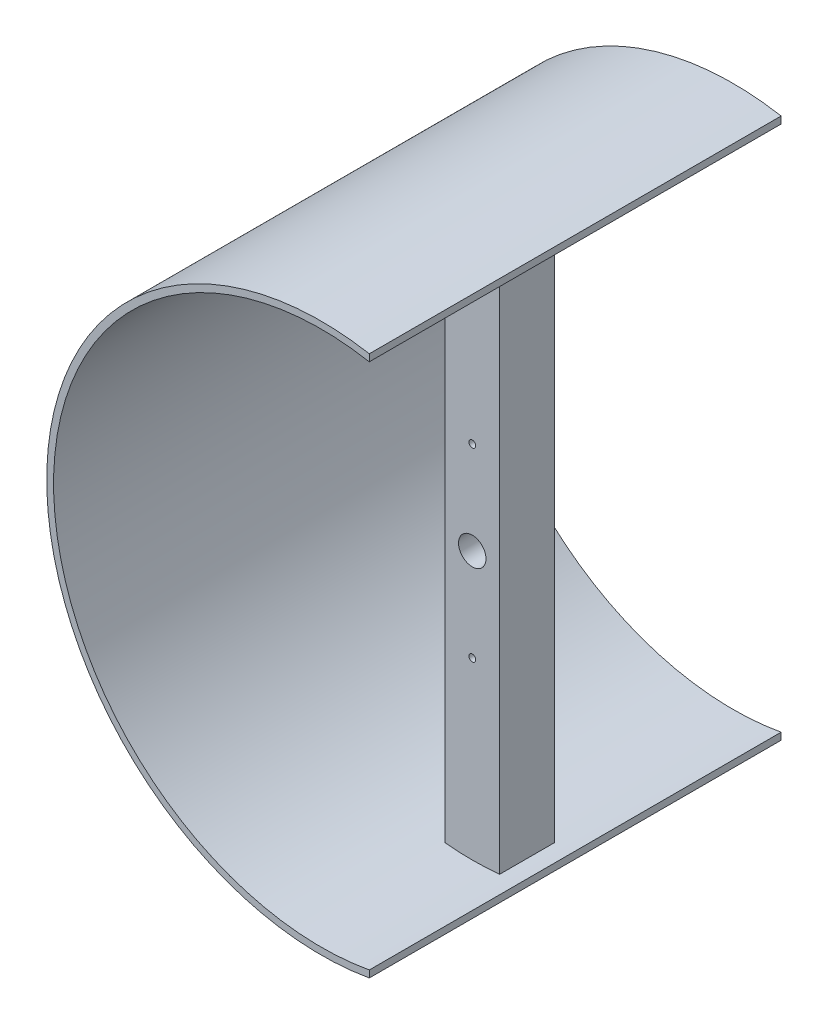
ISO-10303-21;
HEADER;
FILE_DESCRIPTION(('STEP AP214'),'2;1');
FILE_NAME('part.step','',(''),(''),'','','');
FILE_SCHEMA(('AUTOMOTIVE_DESIGN { 1 0 10303 214 1 1 1 1 }'));
ENDSEC;
DATA;
#1=APPLICATION_CONTEXT('core data for automotive mechanical design processes');
#2=APPLICATION_PROTOCOL_DEFINITION('international standard','automotive_design',2000,#1);
#3=PRODUCT_CONTEXT('',#1,'mechanical');
#4=PRODUCT('Part','Part','',(#3));
#5=PRODUCT_RELATED_PRODUCT_CATEGORY('part','',(#4));
#6=PRODUCT_DEFINITION_FORMATION('','',#4);
#7=PRODUCT_DEFINITION_CONTEXT('part definition',#1,'design');
#8=PRODUCT_DEFINITION('design','',#6,#7);
#9=PRODUCT_DEFINITION_SHAPE('','',#8);
#10=(LENGTH_UNIT() NAMED_UNIT(*) SI_UNIT(.MILLI.,.METRE.));
#11=(NAMED_UNIT(*) PLANE_ANGLE_UNIT() SI_UNIT($,.RADIAN.));
#12=(NAMED_UNIT(*) SI_UNIT($,.STERADIAN.) SOLID_ANGLE_UNIT());
#13=UNCERTAINTY_MEASURE_WITH_UNIT(LENGTH_MEASURE(1.E-05),#10,'distance_accuracy_value','');
#14=(GEOMETRIC_REPRESENTATION_CONTEXT(3) GLOBAL_UNCERTAINTY_ASSIGNED_CONTEXT((#13)) GLOBAL_UNIT_ASSIGNED_CONTEXT((#10,
#11,#12)) REPRESENTATION_CONTEXT('',''));
#15=CARTESIAN_POINT('',(0.,0.,0.));
#16=DIRECTION('',(0.,0.,1.));
#17=DIRECTION('',(1.,0.,0.));
#18=AXIS2_PLACEMENT_3D('',#15,#16,#17);
#19=CARTESIAN_POINT('',(0.,0.,60.));
#20=DIRECTION('',(0.,0.,-1.));
#21=DIRECTION('',(-1.,0.,0.));
#22=AXIS2_PLACEMENT_3D('',#19,#20,#21);
#23=PLANE('',#22);
#24=DIRECTION('',(0.,1.,0.));
#25=VECTOR('',#24,1.);
#26=CARTESIAN_POINT('',(11.,80.5,60.));
#27=LINE('',#26,#25);
#28=CARTESIAN_POINT('',(11.,0.117262664969565,60.));
#29=VERTEX_POINT('',#28);
#30=CARTESIAN_POINT('',(11.,1.13334781349824,60.));
#31=VERTEX_POINT('',#30);
#32=EDGE_CURVE('E65',#29,#31,#27,.T.);
#33=ORIENTED_EDGE('',*,*,#32,.T.);
#34=CARTESIAN_POINT('',(4.,39.5,60.));
#35=DIRECTION('',(0.,0.,-1.));
#36=DIRECTION('',(-1.,0.,0.));
#37=AXIS2_PLACEMENT_3D('',#34,#35,#36);
#38=CIRCLE('',#37,39.);
#39=CARTESIAN_POINT('',(11.,77.8666521865018,60.));
#40=VERTEX_POINT('',#39);
#41=EDGE_CURVE('E168',#31,#40,#38,.T.);
#42=ORIENTED_EDGE('',*,*,#41,.T.);
#43=CARTESIAN_POINT('',(11.,78.8827373350304,60.));
#44=VERTEX_POINT('',#43);
#45=EDGE_CURVE('E154',#40,#44,#27,.T.);
#46=ORIENTED_EDGE('',*,*,#45,.T.);
#47=CARTESIAN_POINT('',(4.,39.5,60.));
#48=DIRECTION('',(0.,0.,-1.));
#49=DIRECTION('',(-1.,0.,0.));
#50=AXIS2_PLACEMENT_3D('',#47,#48,#49);
#51=CIRCLE('',#50,40.);
#52=EDGE_CURVE('E166',#29,#44,#51,.T.);
#53=ORIENTED_EDGE('',*,*,#52,.F.);
#54=EDGE_LOOP('',(#33,#42,#46,#53));
#55=FACE_BOUND('',#54,.T.);
#56=ADVANCED_FACE('F39',(#55),#23,.F.);
#57=CARTESIAN_POINT('',(0.,0.,0.));
#58=DIRECTION('',(0.,0.,-1.));
#59=DIRECTION('',(-1.,0.,0.));
#60=AXIS2_PLACEMENT_3D('',#57,#58,#59);
#61=PLANE('',#60);
#62=CARTESIAN_POINT('',(4.,39.5,0.));
#63=DIRECTION('',(0.,0.,-1.));
#64=DIRECTION('',(-1.,0.,0.));
#65=AXIS2_PLACEMENT_3D('',#62,#63,#64);
#66=CIRCLE('',#65,39.);
#67=CARTESIAN_POINT('',(11.,1.13334781349824,0.));
#68=VERTEX_POINT('',#67);
#69=CARTESIAN_POINT('',(11.,77.8666521865018,0.));
#70=VERTEX_POINT('',#69);
#71=EDGE_CURVE('E183',#68,#70,#66,.T.);
#72=ORIENTED_EDGE('',*,*,#71,.F.);
#73=DIRECTION('',(0.,-1.,0.));
#74=VECTOR('',#73,1.);
#75=CARTESIAN_POINT('',(11.,80.5,0.));
#76=LINE('',#75,#74);
#77=CARTESIAN_POINT('',(11.,0.117262664969565,0.));
#78=VERTEX_POINT('',#77);
#79=EDGE_CURVE('E337',#68,#78,#76,.T.);
#80=ORIENTED_EDGE('',*,*,#79,.T.);
#81=CARTESIAN_POINT('',(4.,39.5,0.));
#82=DIRECTION('',(0.,0.,-1.));
#83=DIRECTION('',(-1.,0.,0.));
#84=AXIS2_PLACEMENT_3D('',#81,#82,#83);
#85=CIRCLE('',#84,40.);
#86=CARTESIAN_POINT('',(11.,78.8827373350304,0.));
#87=VERTEX_POINT('',#86);
#88=EDGE_CURVE('E174',#78,#87,#85,.T.);
#89=ORIENTED_EDGE('',*,*,#88,.T.);
#90=EDGE_CURVE('E57',#87,#70,#76,.T.);
#91=ORIENTED_EDGE('',*,*,#90,.T.);
#92=EDGE_LOOP('',(#72,#80,#89,#91));
#93=FACE_BOUND('',#92,.T.);
#94=ADVANCED_FACE('F336',(#93),#61,.T.);
#95=CARTESIAN_POINT('',(4.,39.5,60.));
#96=DIRECTION('',(0.,0.,-1.));
#97=DIRECTION('',(-1.,0.,0.));
#98=AXIS2_PLACEMENT_3D('',#95,#96,#97);
#99=CYLINDRICAL_SURFACE('',#98,39.);
#100=DIRECTION('',(0.,0.,-1.));
#101=VECTOR('',#100,1.);
#102=CARTESIAN_POINT('',(0.,78.2943294825416,60.));
#103=LINE('',#102,#101);
#104=CARTESIAN_POINT('',(0.,78.2943294825416,30.));
#105=VERTEX_POINT('',#104);
#106=CARTESIAN_POINT('',(0.,78.2943294825416,38.));
#107=VERTEX_POINT('',#106);
#108=EDGE_CURVE('E49',#105,#107,#103,.F.);
#109=ORIENTED_EDGE('',*,*,#108,.T.);
#110=CARTESIAN_POINT('',(4.,39.5,38.));
#111=DIRECTION('',(0.,0.,1.));
#112=DIRECTION('',(1.,0.,0.));
#113=AXIS2_PLACEMENT_3D('',#110,#111,#112);
#114=CIRCLE('',#113,39.);
#115=CARTESIAN_POINT('',(7.99999999999999,78.2943294825416,38.));
#116=VERTEX_POINT('',#115);
#117=EDGE_CURVE('E218',#116,#107,#114,.T.);
#118=ORIENTED_EDGE('',*,*,#117,.F.);
#119=DIRECTION('',(0.,0.,-1.));
#120=VECTOR('',#119,1.);
#121=CARTESIAN_POINT('',(7.99999999999999,78.2943294825416,60.));
#122=LINE('',#121,#120);
#123=CARTESIAN_POINT('',(7.99999999999999,78.2943294825416,30.));
#124=VERTEX_POINT('',#123);
#125=EDGE_CURVE('E179',#116,#124,#122,.T.);
#126=ORIENTED_EDGE('',*,*,#125,.T.);
#127=CARTESIAN_POINT('',(4.,39.5,30.));
#128=DIRECTION('',(0.,0.,-1.));
#129=DIRECTION('',(-1.,0.,0.));
#130=AXIS2_PLACEMENT_3D('',#127,#128,#129);
#131=CIRCLE('',#130,39.);
#132=EDGE_CURVE('E316',#105,#124,#131,.T.);
#133=ORIENTED_EDGE('',*,*,#132,.F.);
#134=EDGE_LOOP('',(#109,#118,#126,#133));
#135=FACE_BOUND('',#134,.T.);
#136=CARTESIAN_POINT('',(0.,0.705670517458352,38.));
#137=VERTEX_POINT('',#136);
#138=CARTESIAN_POINT('',(8.,0.705670517458352,38.));
#139=VERTEX_POINT('',#138);
#140=EDGE_CURVE('E214',#137,#139,#114,.T.);
#141=ORIENTED_EDGE('',*,*,#140,.F.);
#142=DIRECTION('',(0.,0.,-1.));
#143=VECTOR('',#142,1.);
#144=CARTESIAN_POINT('',(0.,0.705670517458359,60.));
#145=LINE('',#144,#143);
#146=CARTESIAN_POINT('',(0.,0.705670517458352,30.));
#147=VERTEX_POINT('',#146);
#148=EDGE_CURVE('E11',#137,#147,#145,.T.);
#149=ORIENTED_EDGE('',*,*,#148,.T.);
#150=CARTESIAN_POINT('',(8.,0.705670517458352,30.));
#151=VERTEX_POINT('',#150);
#152=EDGE_CURVE('E294',#151,#147,#131,.T.);
#153=ORIENTED_EDGE('',*,*,#152,.F.);
#154=DIRECTION('',(0.,0.,-1.));
#155=VECTOR('',#154,1.);
#156=CARTESIAN_POINT('',(8.,0.705670517458352,60.));
#157=LINE('',#156,#155);
#158=EDGE_CURVE('E173',#151,#139,#157,.F.);
#159=ORIENTED_EDGE('',*,*,#158,.T.);
#160=EDGE_LOOP('',(#141,#149,#153,#159));
#161=FACE_BOUND('',#160,.T.);
#162=DIRECTION('',(0.,0.,-1.));
#163=VECTOR('',#162,1.);
#164=CARTESIAN_POINT('',(11.,1.13334781349824,60.));
#165=LINE('',#164,#163);
#166=EDGE_CURVE('E333',#31,#68,#165,.T.);
#167=ORIENTED_EDGE('',*,*,#166,.T.);
#168=ORIENTED_EDGE('',*,*,#71,.T.);
#169=DIRECTION('',(0.,0.,-1.));
#170=VECTOR('',#169,1.);
#171=CARTESIAN_POINT('',(11.,77.8666521865018,60.));
#172=LINE('',#171,#170);
#173=EDGE_CURVE('E332',#70,#40,#172,.F.);
#174=ORIENTED_EDGE('',*,*,#173,.T.);
#175=ORIENTED_EDGE('',*,*,#41,.F.);
#176=EDGE_LOOP('',(#167,#168,#174,#175));
#177=FACE_BOUND('',#176,.T.);
#178=ADVANCED_FACE('F331',(#135,#161,#177),#99,.F.);
#179=CARTESIAN_POINT('',(4.,39.5,60.));
#180=DIRECTION('',(0.,0.,-1.));
#181=DIRECTION('',(-1.,0.,0.));
#182=AXIS2_PLACEMENT_3D('',#179,#180,#181);
#183=CYLINDRICAL_SURFACE('',#182,40.);
#184=ORIENTED_EDGE('',*,*,#88,.F.);
#185=DIRECTION('',(0.,0.,-1.));
#186=VECTOR('',#185,1.);
#187=CARTESIAN_POINT('',(11.,0.117262664969565,60.));
#188=LINE('',#187,#186);
#189=EDGE_CURVE('E161',#29,#78,#188,.T.);
#190=ORIENTED_EDGE('',*,*,#189,.F.);
#191=ORIENTED_EDGE('',*,*,#52,.T.);
#192=DIRECTION('',(0.,0.,-1.));
#193=VECTOR('',#192,1.);
#194=CARTESIAN_POINT('',(11.,78.8827373350304,60.));
#195=LINE('',#194,#193);
#196=EDGE_CURVE('E151',#87,#44,#195,.F.);
#197=ORIENTED_EDGE('',*,*,#196,.F.);
#198=EDGE_LOOP('',(#184,#190,#191,#197));
#199=FACE_BOUND('',#198,.T.);
#200=ADVANCED_FACE('F171',(#199),#183,.T.);
#201=CARTESIAN_POINT('',(0.,0.,60.));
#202=DIRECTION('',(1.,0.,0.));
#203=DIRECTION('',(0.,1.,0.));
#204=AXIS2_PLACEMENT_3D('',#201,#202,#203);
#205=PLANE('',#204);
#206=DIRECTION('',(0.,-1.,0.));
#207=VECTOR('',#206,1.);
#208=CARTESIAN_POINT('',(0.,0.,38.));
#209=LINE('',#208,#207);
#210=EDGE_CURVE('E224',#107,#137,#209,.T.);
#211=ORIENTED_EDGE('',*,*,#210,.F.);
#212=ORIENTED_EDGE('',*,*,#108,.F.);
#213=DIRECTION('',(0.,1.,0.));
#214=VECTOR('',#213,1.);
#215=CARTESIAN_POINT('',(0.,0.,30.));
#216=LINE('',#215,#214);
#217=EDGE_CURVE('E323',#147,#105,#216,.T.);
#218=ORIENTED_EDGE('',*,*,#217,.F.);
#219=ORIENTED_EDGE('',*,*,#148,.F.);
#220=EDGE_LOOP('',(#211,#212,#218,#219));
#221=FACE_BOUND('',#220,.T.);
#222=ADVANCED_FACE('F41',(#221),#205,.F.);
#223=CARTESIAN_POINT('',(8.,0.,60.));
#224=DIRECTION('',(-1.,0.,0.));
#225=DIRECTION('',(0.,-1.,0.));
#226=AXIS2_PLACEMENT_3D('',#223,#224,#225);
#227=PLANE('',#226);
#228=DIRECTION('',(0.,1.,0.));
#229=VECTOR('',#228,1.);
#230=CARTESIAN_POINT('',(8.,0.,38.));
#231=LINE('',#230,#229);
#232=EDGE_CURVE('E221',#139,#116,#231,.T.);
#233=ORIENTED_EDGE('',*,*,#232,.F.);
#234=ORIENTED_EDGE('',*,*,#158,.F.);
#235=DIRECTION('',(0.,-1.,0.));
#236=VECTOR('',#235,1.);
#237=CARTESIAN_POINT('',(8.,0.,30.));
#238=LINE('',#237,#236);
#239=EDGE_CURVE('E320',#124,#151,#238,.T.);
#240=ORIENTED_EDGE('',*,*,#239,.F.);
#241=ORIENTED_EDGE('',*,*,#125,.F.);
#242=EDGE_LOOP('',(#233,#234,#240,#241));
#243=FACE_BOUND('',#242,.T.);
#244=ADVANCED_FACE('F363',(#243),#227,.F.);
#245=CARTESIAN_POINT('',(4.,39.5,30.));
#246=DIRECTION('',(0.,0.,-1.));
#247=DIRECTION('',(-1.,0.,0.));
#248=AXIS2_PLACEMENT_3D('',#245,#246,#247);
#249=PLANE('',#248);
#250=CARTESIAN_POINT('',(4.,39.5,30.));
#251=DIRECTION('',(0.,0.,-1.));
#252=DIRECTION('',(-1.,0.,0.));
#253=AXIS2_PLACEMENT_3D('',#250,#251,#252);
#254=CIRCLE('',#253,3.);
#255=CARTESIAN_POINT('',(6.96725784447477,39.9420190995907,30.));
#256=VERTEX_POINT('',#255);
#257=CARTESIAN_POINT('',(6.96725784447477,39.0579809004093,30.));
#258=VERTEX_POINT('',#257);
#259=EDGE_CURVE('E227',#256,#258,#254,.T.);
#260=ORIENTED_EDGE('',*,*,#259,.F.);
#261=DIRECTION('',(0.0738716855153117,-0.997267754456709,0.));
#262=VECTOR('',#261,1.);
#263=CARTESIAN_POINT('',(6.00000000000001,53.,30.));
#264=LINE('',#263,#262);
#265=CARTESIAN_POINT('',(6.00000000000001,53.,30.));
#266=VERTEX_POINT('',#265);
#267=EDGE_CURVE('E233',#266,#256,#264,.T.);
#268=ORIENTED_EDGE('',*,*,#267,.F.);
#269=CARTESIAN_POINT('',(4.00000000000001,53.,30.));
#270=DIRECTION('',(0.,0.,-1.));
#271=DIRECTION('',(-1.,0.,0.));
#272=AXIS2_PLACEMENT_3D('',#269,#270,#271);
#273=CIRCLE('',#272,2.00000000000001);
#274=CARTESIAN_POINT('',(2.,53.,30.));
#275=VERTEX_POINT('',#274);
#276=EDGE_CURVE('E284',#275,#266,#273,.T.);
#277=ORIENTED_EDGE('',*,*,#276,.F.);
#278=DIRECTION('',(0.0738716855153117,0.997267754456709,0.));
#279=VECTOR('',#278,1.);
#280=CARTESIAN_POINT('',(1.03274215552523,39.9420190995907,30.));
#281=LINE('',#280,#279);
#282=CARTESIAN_POINT('',(1.03274215552523,39.9420190995907,30.));
#283=VERTEX_POINT('',#282);
#284=EDGE_CURVE('E280',#283,#275,#281,.T.);
#285=ORIENTED_EDGE('',*,*,#284,.F.);
#286=CARTESIAN_POINT('',(4.,39.5,30.));
#287=DIRECTION('',(0.,0.,-1.));
#288=DIRECTION('',(1.,0.,0.));
#289=AXIS2_PLACEMENT_3D('',#286,#287,#288);
#290=CIRCLE('',#289,3.00000000000001);
#291=CARTESIAN_POINT('',(1.03274215552523,39.0579809004093,30.));
#292=VERTEX_POINT('',#291);
#293=EDGE_CURVE('E276',#292,#283,#290,.T.);
#294=ORIENTED_EDGE('',*,*,#293,.F.);
#295=DIRECTION('',(-0.0738716855153115,0.997267754456709,0.));
#296=VECTOR('',#295,1.);
#297=CARTESIAN_POINT('',(1.99999999999999,26.,30.));
#298=LINE('',#297,#296);
#299=CARTESIAN_POINT('',(1.99999999999999,26.,30.));
#300=VERTEX_POINT('',#299);
#301=EDGE_CURVE('E272',#300,#292,#298,.T.);
#302=ORIENTED_EDGE('',*,*,#301,.F.);
#303=CARTESIAN_POINT('',(4.,26.,30.));
#304=DIRECTION('',(0.,0.,-1.));
#305=DIRECTION('',(1.,0.,0.));
#306=AXIS2_PLACEMENT_3D('',#303,#304,#305);
#307=CIRCLE('',#306,2.00000000000001);
#308=CARTESIAN_POINT('',(6.00000000000001,26.,30.));
#309=VERTEX_POINT('',#308);
#310=EDGE_CURVE('E268',#309,#300,#307,.T.);
#311=ORIENTED_EDGE('',*,*,#310,.F.);
#312=DIRECTION('',(-0.073871685515312,-0.997267754456709,0.));
#313=VECTOR('',#312,1.);
#314=CARTESIAN_POINT('',(6.,26.,30.));
#315=LINE('',#314,#313);
#316=EDGE_CURVE('E264',#258,#309,#315,.T.);
#317=ORIENTED_EDGE('',*,*,#316,.F.);
#318=EDGE_LOOP('',(#260,#268,#277,#285,#294,#302,#311,#317));
#319=FACE_BOUND('',#318,.T.);
#320=ORIENTED_EDGE('',*,*,#217,.T.);
#321=ORIENTED_EDGE('',*,*,#132,.T.);
#322=ORIENTED_EDGE('',*,*,#239,.T.);
#323=ORIENTED_EDGE('',*,*,#152,.T.);
#324=EDGE_LOOP('',(#320,#321,#322,#323));
#325=FACE_BOUND('',#324,.T.);
#326=ADVANCED_FACE('F365',(#319,#325),#249,.T.);
#327=CARTESIAN_POINT('',(4.,39.5,31.5));
#328=DIRECTION('',(0.,0.,-1.));
#329=DIRECTION('',(-1.,0.,0.));
#330=AXIS2_PLACEMENT_3D('',#327,#328,#329);
#331=CYLINDRICAL_SURFACE('',#330,3.);
#332=ORIENTED_EDGE('',*,*,#259,.T.);
#333=DIRECTION('',(0.,0.,-1.));
#334=VECTOR('',#333,1.);
#335=CARTESIAN_POINT('',(6.96725784447477,39.0579809004093,31.5));
#336=LINE('',#335,#334);
#337=CARTESIAN_POINT('',(6.96725784447477,39.0579809004093,31.5));
#338=VERTEX_POINT('',#337);
#339=EDGE_CURVE('E261',#338,#258,#336,.T.);
#340=ORIENTED_EDGE('',*,*,#339,.F.);
#341=CARTESIAN_POINT('',(4.,39.5,31.5));
#342=DIRECTION('',(0.,0.,-1.));
#343=DIRECTION('',(-1.,0.,0.));
#344=AXIS2_PLACEMENT_3D('',#341,#342,#343);
#345=CIRCLE('',#344,3.);
#346=CARTESIAN_POINT('',(6.96725784447477,39.9420190995907,31.5));
#347=VERTEX_POINT('',#346);
#348=EDGE_CURVE('E228',#347,#338,#345,.T.);
#349=ORIENTED_EDGE('',*,*,#348,.F.);
#350=DIRECTION('',(0.,0.,-1.));
#351=VECTOR('',#350,1.);
#352=CARTESIAN_POINT('',(6.96725784447477,39.9420190995907,31.5));
#353=LINE('',#352,#351);
#354=EDGE_CURVE('E291',#347,#256,#353,.T.);
#355=ORIENTED_EDGE('',*,*,#354,.T.);
#356=EDGE_LOOP('',(#332,#340,#349,#355));
#357=FACE_BOUND('',#356,.T.);
#358=ADVANCED_FACE('F371',(#357),#331,.F.);
#359=CARTESIAN_POINT('',(6.00000000000001,53.,31.5));
#360=DIRECTION('',(0.997267754456709,0.0738716855153117,0.));
#361=DIRECTION('',(-0.0738716855153117,0.997267754456709,0.));
#362=AXIS2_PLACEMENT_3D('',#359,#360,#361);
#363=PLANE('',#362);
#364=ORIENTED_EDGE('',*,*,#267,.T.);
#365=ORIENTED_EDGE('',*,*,#354,.F.);
#366=DIRECTION('',(0.0738716855153117,-0.997267754456709,0.));
#367=VECTOR('',#366,1.);
#368=CARTESIAN_POINT('',(6.00000000000001,53.,31.5));
#369=LINE('',#368,#367);
#370=CARTESIAN_POINT('',(6.00000000000001,53.,31.5));
#371=VERTEX_POINT('',#370);
#372=EDGE_CURVE('E257',#371,#347,#369,.T.);
#373=ORIENTED_EDGE('',*,*,#372,.F.);
#374=DIRECTION('',(0.,0.,-1.));
#375=VECTOR('',#374,1.);
#376=CARTESIAN_POINT('',(6.00000000000001,53.,31.5));
#377=LINE('',#376,#375);
#378=EDGE_CURVE('E295',#371,#266,#377,.T.);
#379=ORIENTED_EDGE('',*,*,#378,.T.);
#380=EDGE_LOOP('',(#364,#365,#373,#379));
#381=FACE_BOUND('',#380,.T.);
#382=ADVANCED_FACE('F402',(#381),#363,.F.);
#383=CARTESIAN_POINT('',(4.00000000000001,53.,31.5));
#384=DIRECTION('',(0.,0.,-1.));
#385=DIRECTION('',(-1.,0.,0.));
#386=AXIS2_PLACEMENT_3D('',#383,#384,#385);
#387=CYLINDRICAL_SURFACE('',#386,2.00000000000001);
#388=ORIENTED_EDGE('',*,*,#276,.T.);
#389=ORIENTED_EDGE('',*,*,#378,.F.);
#390=CARTESIAN_POINT('',(4.00000000000001,53.,31.5));
#391=DIRECTION('',(0.,0.,-1.));
#392=DIRECTION('',(-1.,0.,0.));
#393=AXIS2_PLACEMENT_3D('',#390,#391,#392);
#394=CIRCLE('',#393,2.00000000000001);
#395=CARTESIAN_POINT('',(2.,53.,31.5));
#396=VERTEX_POINT('',#395);
#397=EDGE_CURVE('E253',#396,#371,#394,.T.);
#398=ORIENTED_EDGE('',*,*,#397,.F.);
#399=DIRECTION('',(0.,0.,-1.));
#400=VECTOR('',#399,1.);
#401=CARTESIAN_POINT('',(2.,53.,31.5));
#402=LINE('',#401,#400);
#403=EDGE_CURVE('E298',#396,#275,#402,.T.);
#404=ORIENTED_EDGE('',*,*,#403,.T.);
#405=EDGE_LOOP('',(#388,#389,#398,#404));
#406=FACE_BOUND('',#405,.T.);
#407=ADVANCED_FACE('F424',(#406),#387,.F.);
#408=CARTESIAN_POINT('',(1.03274215552523,39.9420190995907,31.5));
#409=DIRECTION('',(-0.997267754456709,0.0738716855153117,0.));
#410=DIRECTION('',(-0.0738716855153117,-0.997267754456709,0.));
#411=AXIS2_PLACEMENT_3D('',#408,#409,#410);
#412=PLANE('',#411);
#413=ORIENTED_EDGE('',*,*,#284,.T.);
#414=ORIENTED_EDGE('',*,*,#403,.F.);
#415=DIRECTION('',(0.0738716855153117,0.997267754456709,0.));
#416=VECTOR('',#415,1.);
#417=CARTESIAN_POINT('',(1.03274215552523,39.9420190995907,31.5));
#418=LINE('',#417,#416);
#419=CARTESIAN_POINT('',(1.03274215552523,39.9420190995907,31.5));
#420=VERTEX_POINT('',#419);
#421=EDGE_CURVE('E249',#420,#396,#418,.T.);
#422=ORIENTED_EDGE('',*,*,#421,.F.);
#423=DIRECTION('',(0.,0.,-1.));
#424=VECTOR('',#423,1.);
#425=CARTESIAN_POINT('',(1.03274215552523,39.9420190995907,31.5));
#426=LINE('',#425,#424);
#427=EDGE_CURVE('E301',#420,#283,#426,.T.);
#428=ORIENTED_EDGE('',*,*,#427,.T.);
#429=EDGE_LOOP('',(#413,#414,#422,#428));
#430=FACE_BOUND('',#429,.T.);
#431=ADVANCED_FACE('F420',(#430),#412,.F.);
#432=CARTESIAN_POINT('',(4.,39.5,31.5));
#433=DIRECTION('',(0.,0.,-1.));
#434=DIRECTION('',(-1.,0.,0.));
#435=AXIS2_PLACEMENT_3D('',#432,#433,#434);
#436=CYLINDRICAL_SURFACE('',#435,3.00000000000001);
#437=ORIENTED_EDGE('',*,*,#293,.T.);
#438=ORIENTED_EDGE('',*,*,#427,.F.);
#439=CARTESIAN_POINT('',(4.,39.5,31.5));
#440=DIRECTION('',(0.,0.,-1.));
#441=DIRECTION('',(1.,0.,0.));
#442=AXIS2_PLACEMENT_3D('',#439,#440,#441);
#443=CIRCLE('',#442,3.00000000000001);
#444=CARTESIAN_POINT('',(1.03274215552523,39.0579809004093,31.5));
#445=VERTEX_POINT('',#444);
#446=EDGE_CURVE('E245',#445,#420,#443,.T.);
#447=ORIENTED_EDGE('',*,*,#446,.F.);
#448=DIRECTION('',(0.,0.,-1.));
#449=VECTOR('',#448,1.);
#450=CARTESIAN_POINT('',(1.03274215552523,39.0579809004093,31.5));
#451=LINE('',#450,#449);
#452=EDGE_CURVE('E304',#445,#292,#451,.T.);
#453=ORIENTED_EDGE('',*,*,#452,.T.);
#454=EDGE_LOOP('',(#437,#438,#447,#453));
#455=FACE_BOUND('',#454,.T.);
#456=ADVANCED_FACE('F416',(#455),#436,.F.);
#457=CARTESIAN_POINT('',(1.99999999999999,26.,31.5));
#458=DIRECTION('',(-0.997267754456709,-0.0738716855153115,0.));
#459=DIRECTION('',(0.0738716855153115,-0.997267754456709,0.));
#460=AXIS2_PLACEMENT_3D('',#457,#458,#459);
#461=PLANE('',#460);
#462=ORIENTED_EDGE('',*,*,#301,.T.);
#463=ORIENTED_EDGE('',*,*,#452,.F.);
#464=DIRECTION('',(-0.0738716855153115,0.997267754456709,0.));
#465=VECTOR('',#464,1.);
#466=CARTESIAN_POINT('',(1.99999999999999,26.,31.5));
#467=LINE('',#466,#465);
#468=CARTESIAN_POINT('',(1.99999999999999,26.,31.5));
#469=VERTEX_POINT('',#468);
#470=EDGE_CURVE('E241',#469,#445,#467,.T.);
#471=ORIENTED_EDGE('',*,*,#470,.F.);
#472=DIRECTION('',(0.,0.,-1.));
#473=VECTOR('',#472,1.);
#474=CARTESIAN_POINT('',(1.99999999999999,26.,31.5));
#475=LINE('',#474,#473);
#476=EDGE_CURVE('E307',#469,#300,#475,.T.);
#477=ORIENTED_EDGE('',*,*,#476,.T.);
#478=EDGE_LOOP('',(#462,#463,#471,#477));
#479=FACE_BOUND('',#478,.T.);
#480=ADVANCED_FACE('F412',(#479),#461,.F.);
#481=CARTESIAN_POINT('',(4.,26.,31.5));
#482=DIRECTION('',(0.,0.,-1.));
#483=DIRECTION('',(-1.,0.,0.));
#484=AXIS2_PLACEMENT_3D('',#481,#482,#483);
#485=CYLINDRICAL_SURFACE('',#484,2.00000000000001);
#486=ORIENTED_EDGE('',*,*,#310,.T.);
#487=ORIENTED_EDGE('',*,*,#476,.F.);
#488=CARTESIAN_POINT('',(4.,26.,31.5));
#489=DIRECTION('',(0.,0.,-1.));
#490=DIRECTION('',(1.,0.,0.));
#491=AXIS2_PLACEMENT_3D('',#488,#489,#490);
#492=CIRCLE('',#491,2.00000000000001);
#493=CARTESIAN_POINT('',(6.00000000000001,26.,31.5));
#494=VERTEX_POINT('',#493);
#495=EDGE_CURVE('E237',#494,#469,#492,.T.);
#496=ORIENTED_EDGE('',*,*,#495,.F.);
#497=DIRECTION('',(0.,0.,-1.));
#498=VECTOR('',#497,1.);
#499=CARTESIAN_POINT('',(6.00000000000001,26.,31.5));
#500=LINE('',#499,#498);
#501=EDGE_CURVE('E310',#494,#309,#500,.T.);
#502=ORIENTED_EDGE('',*,*,#501,.T.);
#503=EDGE_LOOP('',(#486,#487,#496,#502));
#504=FACE_BOUND('',#503,.T.);
#505=ADVANCED_FACE('F408',(#504),#485,.F.);
#506=CARTESIAN_POINT('',(6.,26.,31.5));
#507=DIRECTION('',(0.997267754456709,-0.073871685515312,0.));
#508=DIRECTION('',(0.073871685515312,0.997267754456709,0.));
#509=AXIS2_PLACEMENT_3D('',#506,#507,#508);
#510=PLANE('',#509);
#511=ORIENTED_EDGE('',*,*,#316,.T.);
#512=ORIENTED_EDGE('',*,*,#501,.F.);
#513=DIRECTION('',(-0.073871685515312,-0.997267754456709,0.));
#514=VECTOR('',#513,1.);
#515=CARTESIAN_POINT('',(6.,26.,31.5));
#516=LINE('',#515,#514);
#517=EDGE_CURVE('E232',#338,#494,#516,.T.);
#518=ORIENTED_EDGE('',*,*,#517,.F.);
#519=ORIENTED_EDGE('',*,*,#339,.T.);
#520=EDGE_LOOP('',(#511,#512,#518,#519));
#521=FACE_BOUND('',#520,.T.);
#522=ADVANCED_FACE('F404',(#521),#510,.F.);
#523=CARTESIAN_POINT('',(4.,39.5,31.5));
#524=DIRECTION('',(0.,0.,-1.));
#525=DIRECTION('',(-1.,0.,0.));
#526=AXIS2_PLACEMENT_3D('',#523,#524,#525);
#527=PLANE('',#526);
#528=CARTESIAN_POINT('',(4.00000000000001,53.,31.5));
#529=DIRECTION('',(0.,0.,-1.));
#530=DIRECTION('',(-1.,0.,0.));
#531=AXIS2_PLACEMENT_3D('',#528,#529,#530);
#532=CIRCLE('',#531,0.5);
#533=CARTESIAN_POINT('',(3.50000000000001,53.,31.5));
#534=VERTEX_POINT('',#533);
#535=EDGE_CURVE('E193',#534,#534,#532,.T.);
#536=ORIENTED_EDGE('',*,*,#535,.F.);
#537=EDGE_LOOP('',(#536));
#538=FACE_BOUND('',#537,.T.);
#539=CARTESIAN_POINT('',(4.00000000000001,26.,31.5));
#540=DIRECTION('',(0.,0.,-1.));
#541=DIRECTION('',(1.,0.,0.));
#542=AXIS2_PLACEMENT_3D('',#539,#540,#541);
#543=CIRCLE('',#542,0.5);
#544=CARTESIAN_POINT('',(4.50000000000001,26.,31.5));
#545=VERTEX_POINT('',#544);
#546=EDGE_CURVE('E201',#545,#545,#543,.T.);
#547=ORIENTED_EDGE('',*,*,#546,.F.);
#548=EDGE_LOOP('',(#547));
#549=FACE_BOUND('',#548,.T.);
#550=CARTESIAN_POINT('',(4.,39.5,31.5));
#551=DIRECTION('',(0.,0.,-1.));
#552=DIRECTION('',(-1.,0.,0.));
#553=AXIS2_PLACEMENT_3D('',#550,#551,#552);
#554=CIRCLE('',#553,2.);
#555=CARTESIAN_POINT('',(2.,39.5,31.5));
#556=VERTEX_POINT('',#555);
#557=EDGE_CURVE('E199',#556,#556,#554,.T.);
#558=ORIENTED_EDGE('',*,*,#557,.F.);
#559=EDGE_LOOP('',(#558));
#560=FACE_BOUND('',#559,.T.);
#561=ORIENTED_EDGE('',*,*,#348,.T.);
#562=ORIENTED_EDGE('',*,*,#517,.T.);
#563=ORIENTED_EDGE('',*,*,#495,.T.);
#564=ORIENTED_EDGE('',*,*,#470,.T.);
#565=ORIENTED_EDGE('',*,*,#446,.T.);
#566=ORIENTED_EDGE('',*,*,#421,.T.);
#567=ORIENTED_EDGE('',*,*,#397,.T.);
#568=ORIENTED_EDGE('',*,*,#372,.T.);
#569=EDGE_LOOP('',(#561,#562,#563,#564,#565,#566,#567,#568));
#570=FACE_BOUND('',#569,.T.);
#571=ADVANCED_FACE('F407',(#538,#549,#560,#570),#527,.T.);
#572=CARTESIAN_POINT('',(4.,39.5,38.));
#573=DIRECTION('',(0.,0.,1.));
#574=DIRECTION('',(1.,0.,0.));
#575=AXIS2_PLACEMENT_3D('',#572,#573,#574);
#576=PLANE('',#575);
#577=CARTESIAN_POINT('',(4.00000000000001,53.,38.));
#578=DIRECTION('',(0.,0.,1.));
#579=DIRECTION('',(1.,0.,0.));
#580=AXIS2_PLACEMENT_3D('',#577,#578,#579);
#581=CIRCLE('',#580,0.5);
#582=CARTESIAN_POINT('',(4.50000000000001,53.,38.));
#583=VERTEX_POINT('',#582);
#584=EDGE_CURVE('E43',#583,#583,#581,.T.);
#585=ORIENTED_EDGE('',*,*,#584,.F.);
#586=EDGE_LOOP('',(#585));
#587=FACE_BOUND('',#586,.T.);
#588=CARTESIAN_POINT('',(4.00000000000001,26.,38.));
#589=DIRECTION('',(0.,0.,1.));
#590=DIRECTION('',(1.,0.,0.));
#591=AXIS2_PLACEMENT_3D('',#588,#589,#590);
#592=CIRCLE('',#591,0.5);
#593=CARTESIAN_POINT('',(4.50000000000001,26.,38.));
#594=VERTEX_POINT('',#593);
#595=EDGE_CURVE('E190',#594,#594,#592,.T.);
#596=ORIENTED_EDGE('',*,*,#595,.F.);
#597=EDGE_LOOP('',(#596));
#598=FACE_BOUND('',#597,.T.);
#599=CARTESIAN_POINT('',(4.,39.5,38.));
#600=DIRECTION('',(0.,0.,-1.));
#601=DIRECTION('',(-1.,0.,0.));
#602=AXIS2_PLACEMENT_3D('',#599,#600,#601);
#603=CIRCLE('',#602,2.);
#604=CARTESIAN_POINT('',(2.,39.5,38.));
#605=VERTEX_POINT('',#604);
#606=EDGE_CURVE('E210',#605,#605,#603,.T.);
#607=ORIENTED_EDGE('',*,*,#606,.T.);
#608=EDGE_LOOP('',(#607));
#609=FACE_BOUND('',#608,.T.);
#610=ORIENTED_EDGE('',*,*,#210,.T.);
#611=ORIENTED_EDGE('',*,*,#140,.T.);
#612=ORIENTED_EDGE('',*,*,#232,.T.);
#613=ORIENTED_EDGE('',*,*,#117,.T.);
#614=EDGE_LOOP('',(#610,#611,#612,#613));
#615=FACE_BOUND('',#614,.T.);
#616=ADVANCED_FACE('F390',(#587,#598,#609,#615),#576,.T.);
#617=CARTESIAN_POINT('',(4.,39.5,38.));
#618=DIRECTION('',(0.,0.,-1.));
#619=DIRECTION('',(-1.,0.,0.));
#620=AXIS2_PLACEMENT_3D('',#617,#618,#619);
#621=CYLINDRICAL_SURFACE('',#620,2.);
#622=ORIENTED_EDGE('',*,*,#606,.F.);
#623=EDGE_LOOP('',(#622));
#624=FACE_BOUND('',#623,.T.);
#625=ORIENTED_EDGE('',*,*,#557,.T.);
#626=EDGE_LOOP('',(#625));
#627=FACE_BOUND('',#626,.T.);
#628=ADVANCED_FACE('F437',(#624,#627),#621,.F.);
#629=CARTESIAN_POINT('',(4.00000000000001,26.,60.));
#630=DIRECTION('',(0.,0.,-1.));
#631=DIRECTION('',(-1.,0.,0.));
#632=AXIS2_PLACEMENT_3D('',#629,#630,#631);
#633=CYLINDRICAL_SURFACE('',#632,0.5);
#634=ORIENTED_EDGE('',*,*,#595,.T.);
#635=EDGE_LOOP('',(#634));
#636=FACE_BOUND('',#635,.T.);
#637=ORIENTED_EDGE('',*,*,#546,.T.);
#638=EDGE_LOOP('',(#637));
#639=FACE_BOUND('',#638,.T.);
#640=ADVANCED_FACE('F441',(#636,#639),#633,.F.);
#641=CARTESIAN_POINT('',(4.00000000000001,53.,60.));
#642=DIRECTION('',(0.,0.,-1.));
#643=DIRECTION('',(-1.,0.,0.));
#644=AXIS2_PLACEMENT_3D('',#641,#642,#643);
#645=CYLINDRICAL_SURFACE('',#644,0.5);
#646=ORIENTED_EDGE('',*,*,#584,.T.);
#647=EDGE_LOOP('',(#646));
#648=FACE_BOUND('',#647,.T.);
#649=ORIENTED_EDGE('',*,*,#535,.T.);
#650=EDGE_LOOP('',(#649));
#651=FACE_BOUND('',#650,.T.);
#652=ADVANCED_FACE('F353',(#648,#651),#645,.F.);
#653=CARTESIAN_POINT('',(11.,80.5,60.001));
#654=DIRECTION('',(1.,0.,0.));
#655=DIRECTION('',(0.,1.,0.));
#656=AXIS2_PLACEMENT_3D('',#653,#654,#655);
#657=PLANE('',#656);
#658=ORIENTED_EDGE('',*,*,#90,.F.);
#659=ORIENTED_EDGE('',*,*,#196,.T.);
#660=ORIENTED_EDGE('',*,*,#45,.F.);
#661=ORIENTED_EDGE('',*,*,#173,.F.);
#662=EDGE_LOOP('',(#658,#659,#660,#661));
#663=FACE_BOUND('',#662,.T.);
#664=ADVANCED_FACE('F153',(#663),#657,.T.);
#665=ORIENTED_EDGE('',*,*,#32,.F.);
#666=ORIENTED_EDGE('',*,*,#189,.T.);
#667=ORIENTED_EDGE('',*,*,#79,.F.);
#668=ORIENTED_EDGE('',*,*,#166,.F.);
#669=EDGE_LOOP('',(#665,#666,#667,#668));
#670=FACE_BOUND('',#669,.T.);
#671=ADVANCED_FACE('F346',(#670),#657,.T.);
#672=CLOSED_SHELL('',(#56,#94,#178,#200,#222,#244,#326,#358,#382,#407,#431,#456,#480,#505,#522,
#571,#616,#628,#640,#652,#664,#671));
#673=MANIFOLD_SOLID_BREP('B2',#672);
#674=ADVANCED_BREP_SHAPE_REPRESENTATION('',(#18,#673),#14);
#675=SHAPE_DEFINITION_REPRESENTATION(#9,#674);
ENDSEC;
END-ISO-10303-21;
